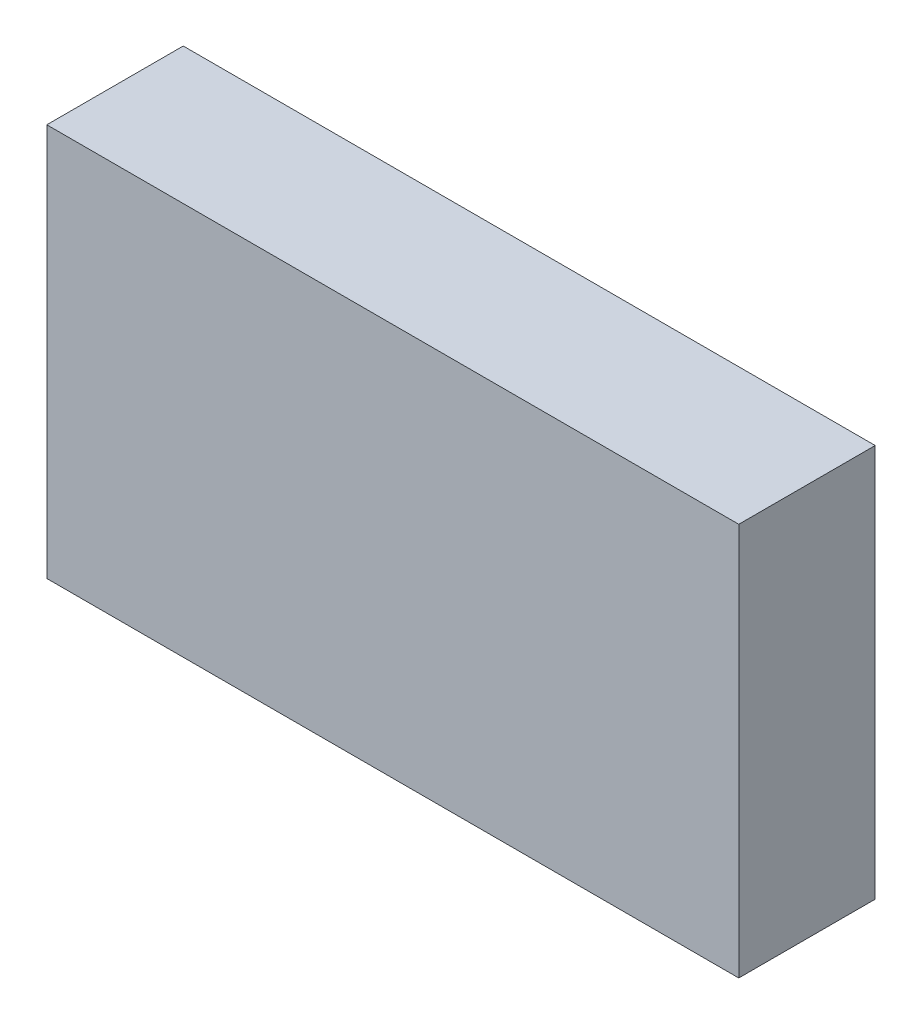
ISO-10303-21;
HEADER;
FILE_DESCRIPTION(('STEP AP214'),'2;1');
FILE_NAME('part.step','',(''),(''),'','','');
FILE_SCHEMA(('AUTOMOTIVE_DESIGN { 1 0 10303 214 1 1 1 1 }'));
ENDSEC;
DATA;
#1=APPLICATION_CONTEXT('core data for automotive mechanical design processes');
#2=APPLICATION_PROTOCOL_DEFINITION('international standard','automotive_design',2000,#1);
#3=PRODUCT_CONTEXT('',#1,'mechanical');
#4=PRODUCT('Part','Part','',(#3));
#5=PRODUCT_RELATED_PRODUCT_CATEGORY('part','',(#4));
#6=PRODUCT_DEFINITION_FORMATION('','',#4);
#7=PRODUCT_DEFINITION_CONTEXT('part definition',#1,'design');
#8=PRODUCT_DEFINITION('design','',#6,#7);
#9=PRODUCT_DEFINITION_SHAPE('','',#8);
#10=(LENGTH_UNIT() NAMED_UNIT(*) SI_UNIT(.MILLI.,.METRE.));
#11=(NAMED_UNIT(*) PLANE_ANGLE_UNIT() SI_UNIT($,.RADIAN.));
#12=(NAMED_UNIT(*) SI_UNIT($,.STERADIAN.) SOLID_ANGLE_UNIT());
#13=UNCERTAINTY_MEASURE_WITH_UNIT(LENGTH_MEASURE(1.E-05),#10,'distance_accuracy_value','');
#14=(GEOMETRIC_REPRESENTATION_CONTEXT(3) GLOBAL_UNCERTAINTY_ASSIGNED_CONTEXT((#13)) GLOBAL_UNIT_ASSIGNED_CONTEXT((#10,
#11,#12)) REPRESENTATION_CONTEXT('',''));
#15=CARTESIAN_POINT('',(0.,0.,0.));
#16=DIRECTION('',(0.,0.,1.));
#17=DIRECTION('',(1.,0.,0.));
#18=AXIS2_PLACEMENT_3D('',#15,#16,#17);
#19=CARTESIAN_POINT('',(63.395,-36.,25.));
#20=DIRECTION('',(-1.,0.,0.));
#21=DIRECTION('',(0.,0.,1.));
#22=AXIS2_PLACEMENT_3D('',#19,#20,#21);
#23=PLANE('',#22);
#24=DIRECTION('',(0.,1.,0.));
#25=VECTOR('',#24,1.);
#26=CARTESIAN_POINT('',(63.395,-36.,0.));
#27=LINE('',#26,#25);
#28=CARTESIAN_POINT('',(63.395,-36.,0.));
#29=VERTEX_POINT('',#28);
#30=CARTESIAN_POINT('',(63.395,36.,0.));
#31=VERTEX_POINT('',#30);
#32=EDGE_CURVE('E96',#29,#31,#27,.T.);
#33=ORIENTED_EDGE('',*,*,#32,.T.);
#34=DIRECTION('',(0.,0.,-1.));
#35=VECTOR('',#34,1.);
#36=CARTESIAN_POINT('',(63.395,36.,25.));
#37=LINE('',#36,#35);
#38=CARTESIAN_POINT('',(63.395,36.,25.));
#39=VERTEX_POINT('',#38);
#40=EDGE_CURVE('E11',#39,#31,#37,.T.);
#41=ORIENTED_EDGE('',*,*,#40,.F.);
#42=DIRECTION('',(0.,1.,0.));
#43=VECTOR('',#42,1.);
#44=CARTESIAN_POINT('',(63.395,-36.,25.));
#45=LINE('',#44,#43);
#46=CARTESIAN_POINT('',(63.395,-36.,25.));
#47=VERTEX_POINT('',#46);
#48=EDGE_CURVE('E84',#47,#39,#45,.T.);
#49=ORIENTED_EDGE('',*,*,#48,.F.);
#50=DIRECTION('',(0.,0.,-1.));
#51=VECTOR('',#50,1.);
#52=CARTESIAN_POINT('',(63.395,-36.,25.));
#53=LINE('',#52,#51);
#54=EDGE_CURVE('E92',#47,#29,#53,.T.);
#55=ORIENTED_EDGE('',*,*,#54,.T.);
#56=EDGE_LOOP('',(#33,#41,#49,#55));
#57=FACE_BOUND('',#56,.T.);
#58=ADVANCED_FACE('F33',(#57),#23,.F.);
#59=CARTESIAN_POINT('',(-63.395,36.,25.));
#60=DIRECTION('',(0.,-1.,0.));
#61=DIRECTION('',(0.,0.,-1.));
#62=AXIS2_PLACEMENT_3D('',#59,#60,#61);
#63=PLANE('',#62);
#64=DIRECTION('',(-1.,0.,0.));
#65=VECTOR('',#64,1.);
#66=CARTESIAN_POINT('',(-63.395,36.,0.));
#67=LINE('',#66,#65);
#68=CARTESIAN_POINT('',(-63.395,36.,0.));
#69=VERTEX_POINT('',#68);
#70=EDGE_CURVE('E88',#31,#69,#67,.T.);
#71=ORIENTED_EDGE('',*,*,#70,.T.);
#72=DIRECTION('',(0.,0.,-1.));
#73=VECTOR('',#72,1.);
#74=CARTESIAN_POINT('',(-63.395,36.,25.));
#75=LINE('',#74,#73);
#76=CARTESIAN_POINT('',(-63.395,36.,25.));
#77=VERTEX_POINT('',#76);
#78=EDGE_CURVE('E41',#77,#69,#75,.T.);
#79=ORIENTED_EDGE('',*,*,#78,.F.);
#80=DIRECTION('',(-1.,0.,0.));
#81=VECTOR('',#80,1.);
#82=CARTESIAN_POINT('',(-63.395,36.,25.));
#83=LINE('',#82,#81);
#84=EDGE_CURVE('E79',#39,#77,#83,.T.);
#85=ORIENTED_EDGE('',*,*,#84,.F.);
#86=ORIENTED_EDGE('',*,*,#40,.T.);
#87=EDGE_LOOP('',(#71,#79,#85,#86));
#88=FACE_BOUND('',#87,.T.);
#89=ADVANCED_FACE('F87',(#88),#63,.F.);
#90=CARTESIAN_POINT('',(-63.395,-36.,25.));
#91=DIRECTION('',(1.,0.,0.));
#92=DIRECTION('',(0.,0.,-1.));
#93=AXIS2_PLACEMENT_3D('',#90,#91,#92);
#94=PLANE('',#93);
#95=DIRECTION('',(0.,-1.,0.));
#96=VECTOR('',#95,1.);
#97=CARTESIAN_POINT('',(-63.395,-36.,0.));
#98=LINE('',#97,#96);
#99=CARTESIAN_POINT('',(-63.395,-36.,0.));
#100=VERTEX_POINT('',#99);
#101=EDGE_CURVE('E66',#69,#100,#98,.T.);
#102=ORIENTED_EDGE('',*,*,#101,.T.);
#103=DIRECTION('',(0.,0.,-1.));
#104=VECTOR('',#103,1.);
#105=CARTESIAN_POINT('',(-63.395,-36.,25.));
#106=LINE('',#105,#104);
#107=CARTESIAN_POINT('',(-63.395,-36.,25.));
#108=VERTEX_POINT('',#107);
#109=EDGE_CURVE('E89',#108,#100,#106,.T.);
#110=ORIENTED_EDGE('',*,*,#109,.F.);
#111=DIRECTION('',(0.,-1.,0.));
#112=VECTOR('',#111,1.);
#113=CARTESIAN_POINT('',(-63.395,-36.,25.));
#114=LINE('',#113,#112);
#115=EDGE_CURVE('E82',#77,#108,#114,.T.);
#116=ORIENTED_EDGE('',*,*,#115,.F.);
#117=ORIENTED_EDGE('',*,*,#78,.T.);
#118=EDGE_LOOP('',(#102,#110,#116,#117));
#119=FACE_BOUND('',#118,.T.);
#120=ADVANCED_FACE('F90',(#119),#94,.F.);
#121=CARTESIAN_POINT('',(-63.395,-36.,25.));
#122=DIRECTION('',(0.,1.,0.));
#123=DIRECTION('',(0.,0.,1.));
#124=AXIS2_PLACEMENT_3D('',#121,#122,#123);
#125=PLANE('',#124);
#126=DIRECTION('',(1.,0.,0.));
#127=VECTOR('',#126,1.);
#128=CARTESIAN_POINT('',(-63.395,-36.,0.));
#129=LINE('',#128,#127);
#130=EDGE_CURVE('E72',#100,#29,#129,.T.);
#131=ORIENTED_EDGE('',*,*,#130,.T.);
#132=ORIENTED_EDGE('',*,*,#54,.F.);
#133=DIRECTION('',(1.,0.,0.));
#134=VECTOR('',#133,1.);
#135=CARTESIAN_POINT('',(-63.395,-36.,25.));
#136=LINE('',#135,#134);
#137=EDGE_CURVE('E49',#108,#47,#136,.T.);
#138=ORIENTED_EDGE('',*,*,#137,.F.);
#139=ORIENTED_EDGE('',*,*,#109,.T.);
#140=EDGE_LOOP('',(#131,#132,#138,#139));
#141=FACE_BOUND('',#140,.T.);
#142=ADVANCED_FACE('F103',(#141),#125,.F.);
#143=CARTESIAN_POINT('',(0.,0.,25.));
#144=DIRECTION('',(0.,0.,-1.));
#145=DIRECTION('',(-1.,0.,0.));
#146=AXIS2_PLACEMENT_3D('',#143,#144,#145);
#147=PLANE('',#146);
#148=ORIENTED_EDGE('',*,*,#48,.T.);
#149=ORIENTED_EDGE('',*,*,#84,.T.);
#150=ORIENTED_EDGE('',*,*,#115,.T.);
#151=ORIENTED_EDGE('',*,*,#137,.T.);
#152=EDGE_LOOP('',(#148,#149,#150,#151));
#153=FACE_BOUND('',#152,.T.);
#154=ADVANCED_FACE('F80',(#153),#147,.F.);
#155=CARTESIAN_POINT('',(0.,0.,0.));
#156=DIRECTION('',(0.,0.,-1.));
#157=DIRECTION('',(-1.,0.,0.));
#158=AXIS2_PLACEMENT_3D('',#155,#156,#157);
#159=PLANE('',#158);
#160=ORIENTED_EDGE('',*,*,#32,.F.);
#161=ORIENTED_EDGE('',*,*,#130,.F.);
#162=ORIENTED_EDGE('',*,*,#101,.F.);
#163=ORIENTED_EDGE('',*,*,#70,.F.);
#164=EDGE_LOOP('',(#160,#161,#162,#163));
#165=FACE_BOUND('',#164,.T.);
#166=ADVANCED_FACE('F106',(#165),#159,.T.);
#167=CLOSED_SHELL('',(#58,#89,#120,#142,#154,#166));
#168=MANIFOLD_SOLID_BREP('B2',#167);
#169=ADVANCED_BREP_SHAPE_REPRESENTATION('',(#18,#168),#14);
#170=SHAPE_DEFINITION_REPRESENTATION(#9,#169);
ENDSEC;
END-ISO-10303-21;
